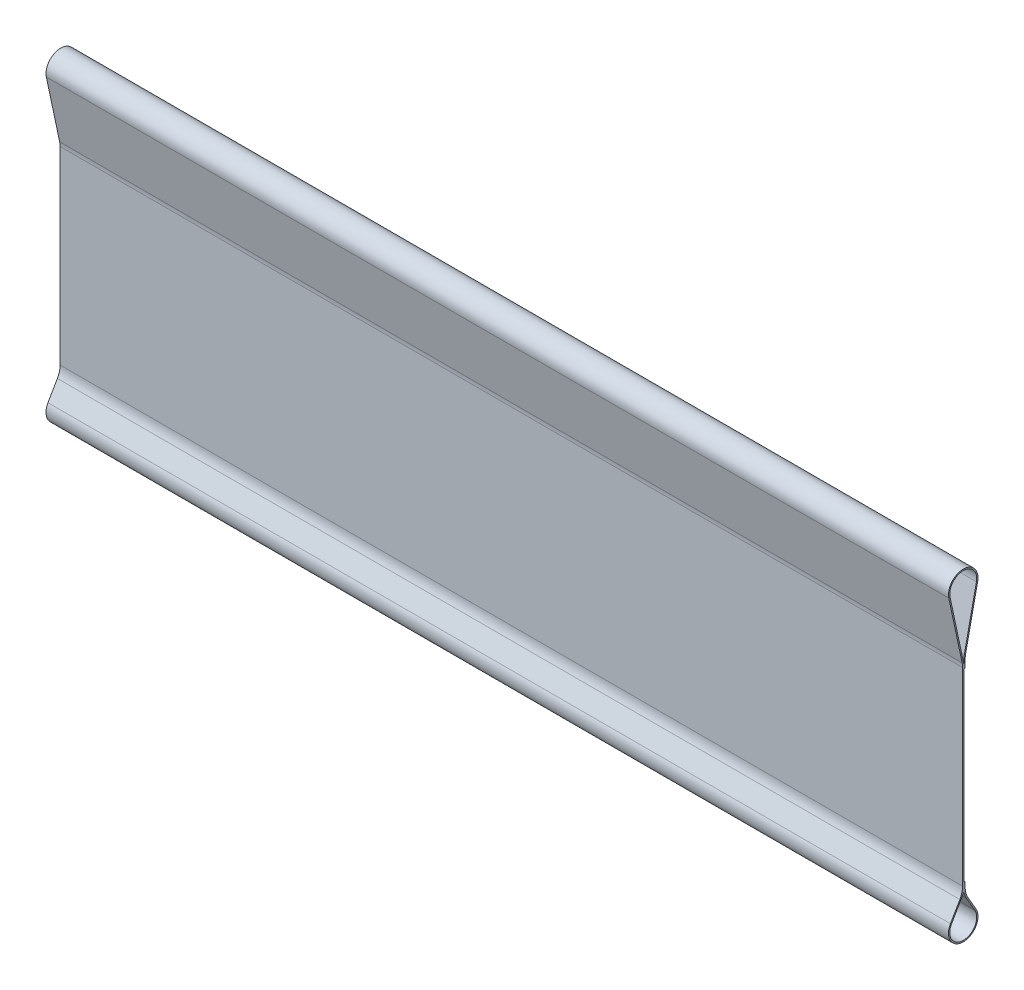
ISO-10303-21;
HEADER;
FILE_DESCRIPTION(('STEP AP214'),'2;1');
FILE_NAME('part.step','',(''),(''),'','','');
FILE_SCHEMA(('AUTOMOTIVE_DESIGN { 1 0 10303 214 1 1 1 1 }'));
ENDSEC;
DATA;
#1=APPLICATION_CONTEXT('core data for automotive mechanical design processes');
#2=APPLICATION_PROTOCOL_DEFINITION('international standard','automotive_design',2000,#1);
#3=PRODUCT_CONTEXT('',#1,'mechanical');
#4=PRODUCT('Part','Part','',(#3));
#5=PRODUCT_RELATED_PRODUCT_CATEGORY('part','',(#4));
#6=PRODUCT_DEFINITION_FORMATION('','',#4);
#7=PRODUCT_DEFINITION_CONTEXT('part definition',#1,'design');
#8=PRODUCT_DEFINITION('design','',#6,#7);
#9=PRODUCT_DEFINITION_SHAPE('','',#8);
#10=(LENGTH_UNIT() NAMED_UNIT(*) SI_UNIT(.MILLI.,.METRE.));
#11=(NAMED_UNIT(*) PLANE_ANGLE_UNIT() SI_UNIT($,.RADIAN.));
#12=(NAMED_UNIT(*) SI_UNIT($,.STERADIAN.) SOLID_ANGLE_UNIT());
#13=UNCERTAINTY_MEASURE_WITH_UNIT(LENGTH_MEASURE(1.E-05),#10,'distance_accuracy_value','');
#14=(GEOMETRIC_REPRESENTATION_CONTEXT(3) GLOBAL_UNCERTAINTY_ASSIGNED_CONTEXT((#13)) GLOBAL_UNIT_ASSIGNED_CONTEXT((#10,
#11,#12)) REPRESENTATION_CONTEXT('',''));
#15=CARTESIAN_POINT('',(0.,0.,0.));
#16=DIRECTION('',(0.,0.,1.));
#17=DIRECTION('',(1.,0.,0.));
#18=AXIS2_PLACEMENT_3D('',#15,#16,#17);
#19=CARTESIAN_POINT('',(558.8,-106.889630657014,-2.38125));
#20=DIRECTION('',(0.,1.,0.));
#21=DIRECTION('',(0.,0.,1.));
#22=AXIS2_PLACEMENT_3D('',#19,#20,#21);
#23=PLANE('',#22);
#24=DIRECTION('',(0.,0.,1.));
#25=VECTOR('',#24,1.);
#26=CARTESIAN_POINT('',(-558.8,-106.889630657014,-2.38125));
#27=LINE('',#26,#25);
#28=CARTESIAN_POINT('',(-558.8,-106.889630657014,-2.38125));
#29=VERTEX_POINT('',#28);
#30=CARTESIAN_POINT('',(-558.8,-106.889630657014,-0.79375));
#31=VERTEX_POINT('',#30);
#32=EDGE_CURVE('E205',#29,#31,#27,.T.);
#33=ORIENTED_EDGE('',*,*,#32,.T.);
#34=DIRECTION('',(-1.,0.,0.));
#35=VECTOR('',#34,1.);
#36=CARTESIAN_POINT('',(-558.8,-106.889630657014,-0.79375));
#37=LINE('',#36,#35);
#38=CARTESIAN_POINT('',(558.8,-106.889630657014,-0.79375));
#39=VERTEX_POINT('',#38);
#40=EDGE_CURVE('E220',#39,#31,#37,.T.);
#41=ORIENTED_EDGE('',*,*,#40,.F.);
#42=DIRECTION('',(0.,0.,1.));
#43=VECTOR('',#42,1.);
#44=CARTESIAN_POINT('',(558.8,-106.889630657014,-2.38125));
#45=LINE('',#44,#43);
#46=CARTESIAN_POINT('',(558.8,-106.889630657014,-2.38125));
#47=VERTEX_POINT('',#46);
#48=EDGE_CURVE('E210',#39,#47,#45,.F.);
#49=ORIENTED_EDGE('',*,*,#48,.T.);
#50=DIRECTION('',(-1.,0.,0.));
#51=VECTOR('',#50,1.);
#52=CARTESIAN_POINT('',(558.8,-106.889630657014,-2.38125));
#53=LINE('',#52,#51);
#54=EDGE_CURVE('E360',#29,#47,#53,.F.);
#55=ORIENTED_EDGE('',*,*,#54,.F.);
#56=EDGE_LOOP('',(#33,#41,#49,#55));
#57=FACE_BOUND('',#56,.T.);
#58=ADVANCED_FACE('F17',(#57),#23,.T.);
#59=CARTESIAN_POINT('',(558.8,121.768600298787,-0.79375));
#60=DIRECTION('',(0.,-1.,0.));
#61=DIRECTION('',(0.,0.,-1.));
#62=AXIS2_PLACEMENT_3D('',#59,#60,#61);
#63=PLANE('',#62);
#64=DIRECTION('',(0.,0.,-1.));
#65=VECTOR('',#64,1.);
#66=CARTESIAN_POINT('',(558.8,121.768600298787,-0.79375));
#67=LINE('',#66,#65);
#68=CARTESIAN_POINT('',(558.8,121.768600298787,-2.38125));
#69=VERTEX_POINT('',#68);
#70=CARTESIAN_POINT('',(558.8,121.768600298787,-0.79375));
#71=VERTEX_POINT('',#70);
#72=EDGE_CURVE('E166',#69,#71,#67,.F.);
#73=ORIENTED_EDGE('',*,*,#72,.T.);
#74=DIRECTION('',(-1.,0.,0.));
#75=VECTOR('',#74,1.);
#76=CARTESIAN_POINT('',(-558.8,121.768600298787,-0.79375));
#77=LINE('',#76,#75);
#78=CARTESIAN_POINT('',(-558.8,121.768600298787,-0.79375));
#79=VERTEX_POINT('',#78);
#80=EDGE_CURVE('E217',#79,#71,#77,.F.);
#81=ORIENTED_EDGE('',*,*,#80,.F.);
#82=DIRECTION('',(0.,0.,-1.));
#83=VECTOR('',#82,1.);
#84=CARTESIAN_POINT('',(-558.8,121.768600298787,-0.79375));
#85=LINE('',#84,#83);
#86=CARTESIAN_POINT('',(-558.8,121.768600298787,-2.38125));
#87=VERTEX_POINT('',#86);
#88=EDGE_CURVE('E200',#79,#87,#85,.T.);
#89=ORIENTED_EDGE('',*,*,#88,.T.);
#90=DIRECTION('',(-1.,0.,0.));
#91=VECTOR('',#90,1.);
#92=CARTESIAN_POINT('',(558.8,121.768600298787,-2.38125));
#93=LINE('',#92,#91);
#94=EDGE_CURVE('E240',#69,#87,#93,.T.);
#95=ORIENTED_EDGE('',*,*,#94,.F.);
#96=EDGE_LOOP('',(#73,#81,#89,#95));
#97=FACE_BOUND('',#96,.T.);
#98=ADVANCED_FACE('F439',(#97),#63,.T.);
#99=CARTESIAN_POINT('',(558.8,-152.04118467148,0.));
#100=DIRECTION('',(1.,0.,0.));
#101=DIRECTION('',(0.,0.,-1.));
#102=AXIS2_PLACEMENT_3D('',#99,#100,#101);
#103=CYLINDRICAL_SURFACE('',#102,18.288);
#104=DIRECTION('',(1.,0.,0.));
#105=VECTOR('',#104,1.);
#106=CARTESIAN_POINT('',(558.8,-142.89718467148,-15.8378725844099));
#107=LINE('',#106,#105);
#108=CARTESIAN_POINT('',(558.8,-142.897184671478,-15.8378725844085));
#109=VERTEX_POINT('',#108);
#110=CARTESIAN_POINT('',(-558.8,-142.897184671478,-15.8378725844085));
#111=VERTEX_POINT('',#110);
#112=EDGE_CURVE('E158',#109,#111,#107,.F.);
#113=ORIENTED_EDGE('',*,*,#112,.F.);
#114=CARTESIAN_POINT('',(558.8,-152.04118467148,0.));
#115=DIRECTION('',(1.,0.,0.));
#116=DIRECTION('',(0.,0.,-1.));
#117=AXIS2_PLACEMENT_3D('',#114,#115,#116);
#118=CIRCLE('',#117,18.288);
#119=CARTESIAN_POINT('',(558.8,-142.897184671479,15.8378725844062));
#120=VERTEX_POINT('',#119);
#121=EDGE_CURVE('E20',#120,#109,#118,.T.);
#122=ORIENTED_EDGE('',*,*,#121,.F.);
#123=DIRECTION('',(1.,0.,0.));
#124=VECTOR('',#123,1.);
#125=CARTESIAN_POINT('',(558.8,-142.897184671483,15.8378725844051));
#126=LINE('',#125,#124);
#127=CARTESIAN_POINT('',(-558.8,-142.897184671479,15.8378725844062));
#128=VERTEX_POINT('',#127);
#129=EDGE_CURVE('E182',#128,#120,#126,.T.);
#130=ORIENTED_EDGE('',*,*,#129,.F.);
#131=CARTESIAN_POINT('',(-558.8,-152.04118467148,0.));
#132=DIRECTION('',(1.,0.,0.));
#133=DIRECTION('',(0.,0.,-1.));
#134=AXIS2_PLACEMENT_3D('',#131,#132,#133);
#135=CIRCLE('',#134,18.288);
#136=EDGE_CURVE('E162',#128,#111,#135,.T.);
#137=ORIENTED_EDGE('',*,*,#136,.T.);
#138=EDGE_LOOP('',(#113,#122,#130,#137));
#139=FACE_BOUND('',#138,.T.);
#140=ADVANCED_FACE('F160',(#139),#103,.T.);
#141=CARTESIAN_POINT('',(558.8,-142.89718467148,-15.8378725844099));
#142=DIRECTION('',(0.,0.500000000000017,-0.866025403784429));
#143=DIRECTION('',(0.,0.866025403784429,0.500000000000017));
#144=AXIS2_PLACEMENT_3D('',#141,#142,#143);
#145=PLANE('',#144);
#146=DIRECTION('',(0.,0.866025403784287,0.500000000000263));
#147=VECTOR('',#146,1.);
#148=CARTESIAN_POINT('',(-558.8,-142.89718467148,-15.8378725844099));
#149=LINE('',#148,#147);
#150=CARTESIAN_POINT('',(-558.8,-125.48372116927,-5.78420474387768));
#151=VERTEX_POINT('',#150);
#152=EDGE_CURVE('E271',#111,#151,#149,.T.);
#153=ORIENTED_EDGE('',*,*,#152,.T.);
#154=DIRECTION('',(-1.,0.,0.));
#155=VECTOR('',#154,1.);
#156=CARTESIAN_POINT('',(2015.70336,-125.483721169267,-5.7842047438755));
#157=LINE('',#156,#155);
#158=CARTESIAN_POINT('',(558.8,-125.48372116927,-5.78420474387768));
#159=VERTEX_POINT('',#158);
#160=EDGE_CURVE('E165',#151,#159,#157,.F.);
#161=ORIENTED_EDGE('',*,*,#160,.T.);
#162=DIRECTION('',(0.,0.866025403784287,0.500000000000263));
#163=VECTOR('',#162,1.);
#164=CARTESIAN_POINT('',(558.8,-142.89718467148,-15.8378725844099));
#165=LINE('',#164,#163);
#166=EDGE_CURVE('E169',#109,#159,#165,.T.);
#167=ORIENTED_EDGE('',*,*,#166,.F.);
#168=ORIENTED_EDGE('',*,*,#112,.T.);
#169=EDGE_LOOP('',(#153,#161,#167,#168));
#170=FACE_BOUND('',#169,.T.);
#171=ADVANCED_FACE('F170',(#170),#145,.T.);
#172=CARTESIAN_POINT('',(2015.70336,-112.783721169267,-27.78125));
#173=DIRECTION('',(-1.,0.,0.));
#174=DIRECTION('',(0.,0.,1.));
#175=AXIS2_PLACEMENT_3D('',#172,#173,#174);
#176=CYLINDRICAL_SURFACE('',#175,25.4);
#177=DIRECTION('',(-1.,0.,0.));
#178=VECTOR('',#177,1.);
#179=CARTESIAN_POINT('',(558.8,-112.783721169267,-2.38125));
#180=LINE('',#179,#178);
#181=CARTESIAN_POINT('',(558.8,-112.783721169267,-2.38125));
#182=VERTEX_POINT('',#181);
#183=CARTESIAN_POINT('',(-558.8,-112.783721169267,-2.38125));
#184=VERTEX_POINT('',#183);
#185=EDGE_CURVE('E221',#182,#184,#180,.T.);
#186=ORIENTED_EDGE('',*,*,#185,.F.);
#187=CARTESIAN_POINT('',(558.8,-112.783721169267,-27.78125));
#188=DIRECTION('',(-1.,0.,0.));
#189=DIRECTION('',(0.,0.,1.));
#190=AXIS2_PLACEMENT_3D('',#187,#188,#189);
#191=CIRCLE('',#190,25.4);
#192=EDGE_CURVE('E175',#159,#182,#191,.T.);
#193=ORIENTED_EDGE('',*,*,#192,.F.);
#194=ORIENTED_EDGE('',*,*,#160,.F.);
#195=CARTESIAN_POINT('',(-558.8,-112.783721169267,-27.78125));
#196=DIRECTION('',(-1.,0.,0.));
#197=DIRECTION('',(0.,0.,1.));
#198=AXIS2_PLACEMENT_3D('',#195,#196,#197);
#199=CIRCLE('',#198,25.4);
#200=EDGE_CURVE('E269',#151,#184,#199,.T.);
#201=ORIENTED_EDGE('',*,*,#200,.T.);
#202=EDGE_LOOP('',(#186,#193,#194,#201));
#203=FACE_BOUND('',#202,.T.);
#204=ADVANCED_FACE('F452',(#203),#176,.F.);
#205=CARTESIAN_POINT('',(558.8,-119.589630657014,-2.38125));
#206=DIRECTION('',(0.,0.,-1.));
#207=DIRECTION('',(-1.,0.,0.));
#208=AXIS2_PLACEMENT_3D('',#205,#206,#207);
#209=PLANE('',#208);
#210=DIRECTION('',(0.,1.,0.));
#211=VECTOR('',#210,1.);
#212=CARTESIAN_POINT('',(558.8,0.,-2.38125));
#213=LINE('',#212,#211);
#214=EDGE_CURVE('E228',#182,#47,#213,.T.);
#215=ORIENTED_EDGE('',*,*,#214,.F.);
#216=ORIENTED_EDGE('',*,*,#185,.T.);
#217=DIRECTION('',(0.,1.,0.));
#218=VECTOR('',#217,1.);
#219=CARTESIAN_POINT('',(-558.8,0.,-2.38125));
#220=LINE('',#219,#218);
#221=EDGE_CURVE('E235',#184,#29,#220,.T.);
#222=ORIENTED_EDGE('',*,*,#221,.T.);
#223=ORIENTED_EDGE('',*,*,#54,.T.);
#224=EDGE_LOOP('',(#215,#216,#222,#223));
#225=FACE_BOUND('',#224,.T.);
#226=ADVANCED_FACE('F367',(#225),#209,.T.);
#227=CARTESIAN_POINT('',(-558.8,0.,-0.79375));
#228=DIRECTION('',(0.,0.,-1.));
#229=DIRECTION('',(-1.,0.,0.));
#230=AXIS2_PLACEMENT_3D('',#227,#228,#229);
#231=PLANE('',#230);
#232=DIRECTION('',(0.,1.,0.));
#233=VECTOR('',#232,1.);
#234=CARTESIAN_POINT('',(558.8,0.,-0.79375));
#235=LINE('',#234,#233);
#236=EDGE_CURVE('E224',#39,#71,#235,.T.);
#237=ORIENTED_EDGE('',*,*,#236,.F.);
#238=ORIENTED_EDGE('',*,*,#40,.T.);
#239=DIRECTION('',(0.,1.,0.));
#240=VECTOR('',#239,1.);
#241=CARTESIAN_POINT('',(-558.8,0.,-0.79375));
#242=LINE('',#241,#240);
#243=EDGE_CURVE('E231',#31,#79,#242,.T.);
#244=ORIENTED_EDGE('',*,*,#243,.T.);
#245=ORIENTED_EDGE('',*,*,#80,.T.);
#246=EDGE_LOOP('',(#237,#238,#244,#245));
#247=FACE_BOUND('',#246,.T.);
#248=ADVANCED_FACE('F442',(#247),#231,.T.);
#249=CARTESIAN_POINT('',(558.8,121.768600298787,-2.38125));
#250=DIRECTION('',(0.,0.,-1.));
#251=DIRECTION('',(-1.,0.,0.));
#252=AXIS2_PLACEMENT_3D('',#249,#250,#251);
#253=PLANE('',#252);
#254=DIRECTION('',(0.,1.,0.));
#255=VECTOR('',#254,1.);
#256=CARTESIAN_POINT('',(-558.8,0.,-2.38125));
#257=LINE('',#256,#255);
#258=CARTESIAN_POINT('',(-558.8,131.798952723056,-2.38125));
#259=VERTEX_POINT('',#258);
#260=EDGE_CURVE('E234',#87,#259,#257,.T.);
#261=ORIENTED_EDGE('',*,*,#260,.T.);
#262=DIRECTION('',(1.,0.,0.));
#263=VECTOR('',#262,1.);
#264=CARTESIAN_POINT('',(-2015.70336,131.798952723056,-2.38125));
#265=LINE('',#264,#263);
#266=CARTESIAN_POINT('',(558.8,131.798952723056,-2.38125));
#267=VERTEX_POINT('',#266);
#268=EDGE_CURVE('E352',#259,#267,#265,.T.);
#269=ORIENTED_EDGE('',*,*,#268,.T.);
#270=DIRECTION('',(0.,1.,0.));
#271=VECTOR('',#270,1.);
#272=CARTESIAN_POINT('',(558.8,0.,-2.38125));
#273=LINE('',#272,#271);
#274=EDGE_CURVE('E227',#69,#267,#273,.T.);
#275=ORIENTED_EDGE('',*,*,#274,.F.);
#276=ORIENTED_EDGE('',*,*,#94,.T.);
#277=EDGE_LOOP('',(#261,#269,#275,#276));
#278=FACE_BOUND('',#277,.T.);
#279=ADVANCED_FACE('F428',(#278),#253,.T.);
#280=CARTESIAN_POINT('',(-2015.70336,131.798952723056,-27.78125));
#281=DIRECTION('',(1.,0.,0.));
#282=DIRECTION('',(0.,0.,-1.));
#283=AXIS2_PLACEMENT_3D('',#280,#281,#282);
#284=CYLINDRICAL_SURFACE('',#283,25.4);
#285=ORIENTED_EDGE('',*,*,#268,.F.);
#286=CARTESIAN_POINT('',(-558.8,131.798952723056,-27.78125));
#287=DIRECTION('',(1.,0.,0.));
#288=DIRECTION('',(0.,0.,-1.));
#289=AXIS2_PLACEMENT_3D('',#286,#287,#288);
#290=CIRCLE('',#289,25.4);
#291=CARTESIAN_POINT('',(-558.8,137.079909669816,-2.93630094136215));
#292=VERTEX_POINT('',#291);
#293=EDGE_CURVE('E267',#259,#292,#290,.F.);
#294=ORIENTED_EDGE('',*,*,#293,.T.);
#295=DIRECTION('',(1.,0.,0.));
#296=VECTOR('',#295,1.);
#297=CARTESIAN_POINT('',(-558.8,137.079909669808,-2.93630094135924));
#298=LINE('',#297,#296);
#299=CARTESIAN_POINT('',(558.8,137.079909669816,-2.93630094136215));
#300=VERTEX_POINT('',#299);
#301=EDGE_CURVE('E349',#300,#292,#298,.F.);
#302=ORIENTED_EDGE('',*,*,#301,.F.);
#303=CARTESIAN_POINT('',(558.8,131.798952723056,-27.78125));
#304=DIRECTION('',(1.,0.,0.));
#305=DIRECTION('',(0.,0.,-1.));
#306=AXIS2_PLACEMENT_3D('',#303,#304,#305);
#307=CIRCLE('',#306,25.4);
#308=EDGE_CURVE('E297',#267,#300,#307,.F.);
#309=ORIENTED_EDGE('',*,*,#308,.F.);
#310=EDGE_LOOP('',(#285,#294,#302,#309));
#311=FACE_BOUND('',#310,.T.);
#312=ADVANCED_FACE('F450',(#311),#284,.F.);
#313=CARTESIAN_POINT('',(-558.8,127.,-0.79375));
#314=DIRECTION('',(0.,-0.207911690817799,-0.978147600733797));
#315=DIRECTION('',(0.,0.978147600733797,-0.207911690817799));
#316=AXIS2_PLACEMENT_3D('',#313,#314,#315);
#317=PLANE('',#316);
#318=DIRECTION('',(0.,0.97814760073382,-0.207911690817693));
#319=VECTOR('',#318,1.);
#320=CARTESIAN_POINT('',(558.8,137.079909669808,-2.93630094136148));
#321=LINE('',#320,#319);
#322=CARTESIAN_POINT('',(558.8,207.423832545616,-17.8883633222195));
#323=VERTEX_POINT('',#322);
#324=EDGE_CURVE('E296',#300,#323,#321,.T.);
#325=ORIENTED_EDGE('',*,*,#324,.F.);
#326=ORIENTED_EDGE('',*,*,#301,.T.);
#327=DIRECTION('',(0.,0.97814760073382,-0.207911690817693));
#328=VECTOR('',#327,1.);
#329=CARTESIAN_POINT('',(-558.8,137.079909669808,-2.93630094136148));
#330=LINE('',#329,#328);
#331=CARTESIAN_POINT('',(-558.8,207.423832545616,-17.8883633222195));
#332=VERTEX_POINT('',#331);
#333=EDGE_CURVE('E266',#292,#332,#330,.T.);
#334=ORIENTED_EDGE('',*,*,#333,.T.);
#335=DIRECTION('',(1.,0.,0.));
#336=VECTOR('',#335,1.);
#337=CARTESIAN_POINT('',(-558.8,207.423832545612,-17.8883633222187));
#338=LINE('',#337,#336);
#339=EDGE_CURVE('E346',#323,#332,#338,.F.);
#340=ORIENTED_EDGE('',*,*,#339,.F.);
#341=EDGE_LOOP('',(#325,#326,#334,#340));
#342=FACE_BOUND('',#341,.T.);
#343=ADVANCED_FACE('F520',(#342),#317,.T.);
#344=CARTESIAN_POINT('',(-558.8,211.226121547293,0.));
#345=DIRECTION('',(1.,0.,0.));
#346=DIRECTION('',(0.,0.,-1.));
#347=AXIS2_PLACEMENT_3D('',#344,#345,#346);
#348=CYLINDRICAL_SURFACE('',#347,18.288);
#349=ORIENTED_EDGE('',*,*,#339,.T.);
#350=CARTESIAN_POINT('',(-558.8,211.226121547293,0.));
#351=DIRECTION('',(1.,0.,0.));
#352=DIRECTION('',(0.,0.,-1.));
#353=AXIS2_PLACEMENT_3D('',#350,#351,#352);
#354=CIRCLE('',#353,18.288);
#355=CARTESIAN_POINT('',(-558.8,207.423832545615,17.8883633222195));
#356=VERTEX_POINT('',#355);
#357=EDGE_CURVE('E264',#332,#356,#354,.T.);
#358=ORIENTED_EDGE('',*,*,#357,.T.);
#359=DIRECTION('',(1.,0.,0.));
#360=VECTOR('',#359,1.);
#361=CARTESIAN_POINT('',(-558.8,207.423832545612,17.8883633222188));
#362=LINE('',#361,#360);
#363=CARTESIAN_POINT('',(558.8,207.423832545615,17.8883633222195));
#364=VERTEX_POINT('',#363);
#365=EDGE_CURVE('E342',#364,#356,#362,.F.);
#366=ORIENTED_EDGE('',*,*,#365,.F.);
#367=CARTESIAN_POINT('',(558.8,211.226121547293,0.));
#368=DIRECTION('',(1.,0.,0.));
#369=DIRECTION('',(0.,0.,-1.));
#370=AXIS2_PLACEMENT_3D('',#367,#368,#369);
#371=CIRCLE('',#370,18.288);
#372=EDGE_CURVE('E292',#323,#364,#371,.T.);
#373=ORIENTED_EDGE('',*,*,#372,.F.);
#374=EDGE_LOOP('',(#349,#358,#366,#373));
#375=FACE_BOUND('',#374,.T.);
#376=ADVANCED_FACE('F516',(#375),#348,.T.);
#377=CARTESIAN_POINT('',(-558.8,207.423832545612,17.8883633222188));
#378=DIRECTION('',(0.,-0.207911690817799,0.978147600733797));
#379=DIRECTION('',(0.,-0.978147600733797,-0.207911690817799));
#380=AXIS2_PLACEMENT_3D('',#377,#378,#379);
#381=PLANE('',#380);
#382=DIRECTION('',(0.,-0.978147600733812,-0.207911690817729));
#383=VECTOR('',#382,1.);
#384=CARTESIAN_POINT('',(-558.8,207.423832545612,17.8883633222188));
#385=LINE('',#384,#383);
#386=CARTESIAN_POINT('',(-558.8,129.611309371017,1.3488009413612));
#387=VERTEX_POINT('',#386);
#388=EDGE_CURVE('E263',#356,#387,#385,.T.);
#389=ORIENTED_EDGE('',*,*,#388,.T.);
#390=DIRECTION('',(1.,0.,0.));
#391=VECTOR('',#390,1.);
#392=CARTESIAN_POINT('',(-2015.70336,129.611309371021,1.34880094136258));
#393=LINE('',#392,#391);
#394=CARTESIAN_POINT('',(558.8,129.611309371017,1.3488009413612));
#395=VERTEX_POINT('',#394);
#396=EDGE_CURVE('E276',#387,#395,#393,.T.);
#397=ORIENTED_EDGE('',*,*,#396,.T.);
#398=DIRECTION('',(0.,-0.978147600733812,-0.207911690817729));
#399=VECTOR('',#398,1.);
#400=CARTESIAN_POINT('',(558.8,207.423832545612,17.8883633222188));
#401=LINE('',#400,#399);
#402=EDGE_CURVE('E295',#364,#395,#401,.T.);
#403=ORIENTED_EDGE('',*,*,#402,.F.);
#404=ORIENTED_EDGE('',*,*,#365,.T.);
#405=EDGE_LOOP('',(#389,#397,#403,#404));
#406=FACE_BOUND('',#405,.T.);
#407=ADVANCED_FACE('F512',(#406),#381,.T.);
#408=CARTESIAN_POINT('',(2020.84392312449,-112.391605771508,-25.7217749648816));
#409=DIRECTION('',(-1.,0.,0.));
#410=DIRECTION('',(0.,0.,1.));
#411=AXIS2_PLACEMENT_3D('',#408,#409,#410);
#412=CYLINDRICAL_SURFACE('',#411,25.4);
#413=DIRECTION('',(1.,0.,0.));
#414=VECTOR('',#413,1.);
#415=CARTESIAN_POINT('',(558.8,-117.265369342985,-0.793749999998308));
#416=LINE('',#415,#414);
#417=CARTESIAN_POINT('',(-558.8,-117.26536934298,-0.793750000002346));
#418=VERTEX_POINT('',#417);
#419=CARTESIAN_POINT('',(558.8,-117.26536934298,-0.793750000002346));
#420=VERTEX_POINT('',#419);
#421=EDGE_CURVE('E332',#418,#420,#416,.T.);
#422=ORIENTED_EDGE('',*,*,#421,.F.);
#423=CARTESIAN_POINT('',(-558.8,-112.391605771508,-25.7217749648816));
#424=DIRECTION('',(-1.,0.,0.));
#425=DIRECTION('',(0.,0.,1.));
#426=AXIS2_PLACEMENT_3D('',#423,#424,#425);
#427=CIRCLE('',#426,25.4);
#428=CARTESIAN_POINT('',(-558.8,-125.091605771515,-3.72472970875147));
#429=VERTEX_POINT('',#428);
#430=EDGE_CURVE('E259',#418,#429,#427,.F.);
#431=ORIENTED_EDGE('',*,*,#430,.T.);
#432=DIRECTION('',(1.,0.,0.));
#433=VECTOR('',#432,1.);
#434=CARTESIAN_POINT('',(558.8,-125.091605771506,-3.72472970874862));
#435=LINE('',#434,#433);
#436=CARTESIAN_POINT('',(558.8,-125.091605771515,-3.72472970875147));
#437=VERTEX_POINT('',#436);
#438=EDGE_CURVE('E339',#437,#429,#435,.F.);
#439=ORIENTED_EDGE('',*,*,#438,.F.);
#440=CARTESIAN_POINT('',(558.8,-112.391605771508,-25.7217749648816));
#441=DIRECTION('',(-1.,0.,0.));
#442=DIRECTION('',(0.,0.,1.));
#443=AXIS2_PLACEMENT_3D('',#440,#441,#442);
#444=CIRCLE('',#443,25.4);
#445=EDGE_CURVE('E284',#420,#437,#444,.F.);
#446=ORIENTED_EDGE('',*,*,#445,.F.);
#447=EDGE_LOOP('',(#422,#431,#439,#446));
#448=FACE_BOUND('',#447,.T.);
#449=ADVANCED_FACE('F508',(#448),#412,.T.);
#450=CARTESIAN_POINT('',(558.8,-120.015,-0.79375));
#451=DIRECTION('',(0.,-0.500000000000017,0.866025403784429));
#452=DIRECTION('',(0.,-0.866025403784429,-0.500000000000017));
#453=AXIS2_PLACEMENT_3D('',#450,#451,#452);
#454=PLANE('',#453);
#455=DIRECTION('',(0.,-0.866025403784192,-0.500000000000427));
#456=VECTOR('',#455,1.);
#457=CARTESIAN_POINT('',(558.8,-125.091605771508,-3.72472970874514));
#458=LINE('',#457,#456);
#459=CARTESIAN_POINT('',(558.8,-143.690934671477,-14.4630572559004));
#460=VERTEX_POINT('',#459);
#461=EDGE_CURVE('E291',#437,#460,#458,.T.);
#462=ORIENTED_EDGE('',*,*,#461,.F.);
#463=ORIENTED_EDGE('',*,*,#438,.T.);
#464=DIRECTION('',(0.,-0.866025403784192,-0.500000000000427));
#465=VECTOR('',#464,1.);
#466=CARTESIAN_POINT('',(-558.8,-125.091605771508,-3.72472970874514));
#467=LINE('',#466,#465);
#468=CARTESIAN_POINT('',(-558.8,-143.690934671477,-14.4630572559004));
#469=VERTEX_POINT('',#468);
#470=EDGE_CURVE('E258',#429,#469,#467,.T.);
#471=ORIENTED_EDGE('',*,*,#470,.T.);
#472=DIRECTION('',(1.,0.,0.));
#473=VECTOR('',#472,1.);
#474=CARTESIAN_POINT('',(558.8,-143.690934671481,-14.4630572559022));
#475=LINE('',#474,#473);
#476=EDGE_CURVE('E336',#469,#460,#475,.T.);
#477=ORIENTED_EDGE('',*,*,#476,.T.);
#478=EDGE_LOOP('',(#462,#463,#471,#477));
#479=FACE_BOUND('',#478,.T.);
#480=ADVANCED_FACE('F504',(#479),#454,.T.);
#481=CARTESIAN_POINT('',(558.8,-152.04118467148,0.));
#482=DIRECTION('',(1.,0.,0.));
#483=DIRECTION('',(0.,0.,-1.));
#484=AXIS2_PLACEMENT_3D('',#481,#482,#483);
#485=CYLINDRICAL_SURFACE('',#484,16.7005);
#486=CARTESIAN_POINT('',(-558.8,-152.04118467148,0.));
#487=DIRECTION('',(1.,0.,0.));
#488=DIRECTION('',(0.,0.,-1.));
#489=AXIS2_PLACEMENT_3D('',#486,#487,#488);
#490=CIRCLE('',#489,16.7005);
#491=CARTESIAN_POINT('',(-558.8,-143.690934671479,14.4630572558998));
#492=VERTEX_POINT('',#491);
#493=EDGE_CURVE('E256',#469,#492,#490,.F.);
#494=ORIENTED_EDGE('',*,*,#493,.T.);
#495=DIRECTION('',(1.,0.,0.));
#496=VECTOR('',#495,1.);
#497=CARTESIAN_POINT('',(558.8,-143.69093467148,14.4630572559003));
#498=LINE('',#497,#496);
#499=CARTESIAN_POINT('',(558.8,-143.690934671479,14.4630572558998));
#500=VERTEX_POINT('',#499);
#501=EDGE_CURVE('E333',#500,#492,#498,.F.);
#502=ORIENTED_EDGE('',*,*,#501,.F.);
#503=CARTESIAN_POINT('',(558.8,-152.04118467148,0.));
#504=DIRECTION('',(1.,0.,0.));
#505=DIRECTION('',(0.,0.,-1.));
#506=AXIS2_PLACEMENT_3D('',#503,#504,#505);
#507=CIRCLE('',#506,16.7005);
#508=EDGE_CURVE('E288',#460,#500,#507,.F.);
#509=ORIENTED_EDGE('',*,*,#508,.F.);
#510=ORIENTED_EDGE('',*,*,#476,.F.);
#511=EDGE_LOOP('',(#494,#502,#509,#510));
#512=FACE_BOUND('',#511,.T.);
#513=ADVANCED_FACE('F500',(#512),#485,.F.);
#514=CARTESIAN_POINT('',(558.8,-143.69093467148,14.4630572559003));
#515=DIRECTION('',(0.,-0.500000000000092,-0.866025403784386));
#516=DIRECTION('',(0.,0.866025403784386,-0.500000000000092));
#517=AXIS2_PLACEMENT_3D('',#514,#515,#516);
#518=PLANE('',#517);
#519=DIRECTION('',(0.,0.866025403784354,-0.500000000000147));
#520=VECTOR('',#519,1.);
#521=CARTESIAN_POINT('',(-558.8,-143.69093467148,14.4630572559003));
#522=LINE('',#521,#520);
#523=EDGE_CURVE('E255',#492,#418,#522,.T.);
#524=ORIENTED_EDGE('',*,*,#523,.T.);
#525=ORIENTED_EDGE('',*,*,#421,.T.);
#526=DIRECTION('',(0.,0.866025403784354,-0.500000000000147));
#527=VECTOR('',#526,1.);
#528=CARTESIAN_POINT('',(558.8,-143.69093467148,14.4630572559003));
#529=LINE('',#528,#527);
#530=EDGE_CURVE('E287',#500,#420,#529,.T.);
#531=ORIENTED_EDGE('',*,*,#530,.F.);
#532=ORIENTED_EDGE('',*,*,#501,.T.);
#533=EDGE_LOOP('',(#524,#525,#531,#532));
#534=FACE_BOUND('',#533,.T.);
#535=ADVANCED_FACE('F496',(#534),#518,.T.);
#536=CARTESIAN_POINT('',(-2015.70336,131.965805696537,-26.19375));
#537=DIRECTION('',(1.,0.,0.));
#538=DIRECTION('',(0.,0.,-1.));
#539=AXIS2_PLACEMENT_3D('',#536,#537,#538);
#540=CYLINDRICAL_SURFACE('',#539,25.4);
#541=DIRECTION('',(-1.,0.,0.));
#542=VECTOR('',#541,1.);
#543=CARTESIAN_POINT('',(558.8,131.965805696537,-0.79375));
#544=LINE('',#543,#542);
#545=CARTESIAN_POINT('',(-558.8,131.965805696537,-0.79375));
#546=VERTEX_POINT('',#545);
#547=CARTESIAN_POINT('',(558.8,131.965805696537,-0.79375));
#548=VERTEX_POINT('',#547);
#549=EDGE_CURVE('E328',#546,#548,#544,.F.);
#550=ORIENTED_EDGE('',*,*,#549,.T.);
#551=CARTESIAN_POINT('',(558.8,131.965805696537,-26.19375));
#552=DIRECTION('',(1.,0.,0.));
#553=DIRECTION('',(0.,0.,-1.));
#554=AXIS2_PLACEMENT_3D('',#551,#552,#553);
#555=CIRCLE('',#554,25.4);
#556=CARTESIAN_POINT('',(558.8,137.246762643312,-1.34880094136037));
#557=VERTEX_POINT('',#556);
#558=EDGE_CURVE('E277',#557,#548,#555,.T.);
#559=ORIENTED_EDGE('',*,*,#558,.F.);
#560=DIRECTION('',(1.,0.,0.));
#561=VECTOR('',#560,1.);
#562=CARTESIAN_POINT('',(-558.8,137.246762643315,-1.34880094136057));
#563=LINE('',#562,#561);
#564=CARTESIAN_POINT('',(-558.8,137.246762643312,-1.34880094136037));
#565=VERTEX_POINT('',#564);
#566=EDGE_CURVE('E183',#565,#557,#563,.T.);
#567=ORIENTED_EDGE('',*,*,#566,.F.);
#568=CARTESIAN_POINT('',(-558.8,131.965805696537,-26.19375));
#569=DIRECTION('',(1.,0.,0.));
#570=DIRECTION('',(0.,0.,-1.));
#571=AXIS2_PLACEMENT_3D('',#568,#569,#570);
#572=CIRCLE('',#571,25.4);
#573=EDGE_CURVE('E252',#565,#546,#572,.T.);
#574=ORIENTED_EDGE('',*,*,#573,.T.);
#575=EDGE_LOOP('',(#550,#559,#567,#574));
#576=FACE_BOUND('',#575,.T.);
#577=ADVANCED_FACE('F492',(#576),#540,.T.);
#578=CARTESIAN_POINT('',(558.8,127.,-0.79375));
#579=DIRECTION('',(0.,0.,-1.));
#580=DIRECTION('',(-1.,0.,0.));
#581=AXIS2_PLACEMENT_3D('',#578,#579,#580);
#582=PLANE('',#581);
#583=DIRECTION('',(1.,0.,0.));
#584=VECTOR('',#583,1.);
#585=CARTESIAN_POINT('',(558.8,127.,-0.793749999998688));
#586=LINE('',#585,#584);
#587=CARTESIAN_POINT('',(-558.8,127.,-0.793749999999606));
#588=VERTEX_POINT('',#587);
#589=CARTESIAN_POINT('',(558.8,127.,-0.793749999999606));
#590=VERTEX_POINT('',#589);
#591=EDGE_CURVE('E318',#588,#590,#586,.T.);
#592=ORIENTED_EDGE('',*,*,#591,.T.);
#593=DIRECTION('',(0.,1.,0.));
#594=VECTOR('',#593,1.);
#595=CARTESIAN_POINT('',(558.8,0.,-0.79375));
#596=LINE('',#595,#594);
#597=EDGE_CURVE('E195',#548,#590,#596,.F.);
#598=ORIENTED_EDGE('',*,*,#597,.F.);
#599=ORIENTED_EDGE('',*,*,#549,.F.);
#600=DIRECTION('',(0.,1.,0.));
#601=VECTOR('',#600,1.);
#602=CARTESIAN_POINT('',(-558.8,0.,-0.79375));
#603=LINE('',#602,#601);
#604=EDGE_CURVE('E254',#546,#588,#603,.F.);
#605=ORIENTED_EDGE('',*,*,#604,.T.);
#606=EDGE_LOOP('',(#592,#598,#599,#605));
#607=FACE_BOUND('',#606,.T.);
#608=ADVANCED_FACE('F488',(#607),#582,.F.);
#609=CARTESIAN_POINT('',(558.8,130.901153122875,0.));
#610=DIRECTION('',(0.,-0.199380338723698,0.97992218085439));
#611=DIRECTION('',(0.,-0.97992218085439,-0.199380338723698));
#612=AXIS2_PLACEMENT_3D('',#609,#610,#611);
#613=PLANE('',#612);
#614=DIRECTION('',(0.,0.979922180854323,0.199380338724028));
#615=VECTOR('',#614,1.);
#616=CARTESIAN_POINT('',(558.8,127.,-0.79375));
#617=LINE('',#616,#615);
#618=CARTESIAN_POINT('',(558.8,130.901153122874,-1.4097892173129E-13));
#619=VERTEX_POINT('',#618);
#620=EDGE_CURVE('E191',#590,#619,#617,.T.);
#621=ORIENTED_EDGE('',*,*,#620,.F.);
#622=ORIENTED_EDGE('',*,*,#591,.F.);
#623=DIRECTION('',(0.,0.979922180854323,0.199380338724028));
#624=VECTOR('',#623,1.);
#625=CARTESIAN_POINT('',(-558.8,127.,-0.79375));
#626=LINE('',#625,#624);
#627=CARTESIAN_POINT('',(-558.8,130.901153122874,-1.86190152323935E-13));
#628=VERTEX_POINT('',#627);
#629=EDGE_CURVE('E321',#588,#628,#626,.T.);
#630=ORIENTED_EDGE('',*,*,#629,.T.);
#631=DIRECTION('',(1.,0.,0.));
#632=VECTOR('',#631,1.);
#633=CARTESIAN_POINT('',(-558.8,130.901153122875,0.));
#634=LINE('',#633,#632);
#635=EDGE_CURVE('E315',#619,#628,#634,.F.);
#636=ORIENTED_EDGE('',*,*,#635,.F.);
#637=EDGE_LOOP('',(#621,#622,#630,#636));
#638=FACE_BOUND('',#637,.T.);
#639=ADVANCED_FACE('F484',(#638),#613,.F.);
#640=CARTESIAN_POINT('',(-558.8,130.901153122875,0.));
#641=DIRECTION('',(0.,0.207911690817799,-0.978147600733797));
#642=DIRECTION('',(0.,0.978147600733797,0.207911690817799));
#643=AXIS2_PLACEMENT_3D('',#640,#641,#642);
#644=PLANE('',#643);
#645=DIRECTION('',(0.,0.97814760073381,0.207911690817739));
#646=VECTOR('',#645,1.);
#647=CARTESIAN_POINT('',(558.8,130.901153122875,0.));
#648=LINE('',#647,#646);
#649=CARTESIAN_POINT('',(558.8,207.753892354787,16.3355540060552));
#650=VERTEX_POINT('',#649);
#651=EDGE_CURVE('E194',#619,#650,#648,.T.);
#652=ORIENTED_EDGE('',*,*,#651,.F.);
#653=ORIENTED_EDGE('',*,*,#635,.T.);
#654=DIRECTION('',(0.,0.97814760073381,0.207911690817739));
#655=VECTOR('',#654,1.);
#656=CARTESIAN_POINT('',(-558.8,130.901153122875,0.));
#657=LINE('',#656,#655);
#658=CARTESIAN_POINT('',(-558.8,207.753892354787,16.3355540060552));
#659=VERTEX_POINT('',#658);
#660=EDGE_CURVE('E251',#628,#659,#657,.T.);
#661=ORIENTED_EDGE('',*,*,#660,.T.);
#662=DIRECTION('',(1.,0.,0.));
#663=VECTOR('',#662,1.);
#664=CARTESIAN_POINT('',(-558.8,207.753892354783,16.3355540060533));
#665=LINE('',#664,#663);
#666=EDGE_CURVE('E312',#659,#650,#665,.T.);
#667=ORIENTED_EDGE('',*,*,#666,.T.);
#668=EDGE_LOOP('',(#652,#653,#661,#667));
#669=FACE_BOUND('',#668,.T.);
#670=ADVANCED_FACE('F480',(#669),#644,.T.);
#671=CARTESIAN_POINT('',(-558.8,211.226121547293,0.));
#672=DIRECTION('',(1.,0.,0.));
#673=DIRECTION('',(0.,0.,-1.));
#674=AXIS2_PLACEMENT_3D('',#671,#672,#673);
#675=CYLINDRICAL_SURFACE('',#674,16.7005);
#676=CARTESIAN_POINT('',(558.8,211.226121547293,0.));
#677=DIRECTION('',(1.,0.,0.));
#678=DIRECTION('',(0.,0.,-1.));
#679=AXIS2_PLACEMENT_3D('',#676,#677,#678);
#680=CIRCLE('',#679,16.7005);
#681=CARTESIAN_POINT('',(558.8,207.753892354786,-16.3355540060563));
#682=VERTEX_POINT('',#681);
#683=EDGE_CURVE('E281',#650,#682,#680,.F.);
#684=ORIENTED_EDGE('',*,*,#683,.F.);
#685=ORIENTED_EDGE('',*,*,#666,.F.);
#686=CARTESIAN_POINT('',(-558.8,211.226121547293,0.));
#687=DIRECTION('',(1.,0.,0.));
#688=DIRECTION('',(0.,0.,-1.));
#689=AXIS2_PLACEMENT_3D('',#686,#687,#688);
#690=CIRCLE('',#689,16.7005);
#691=CARTESIAN_POINT('',(-558.8,207.753892354786,-16.3355540060563));
#692=VERTEX_POINT('',#691);
#693=EDGE_CURVE('E248',#659,#692,#690,.F.);
#694=ORIENTED_EDGE('',*,*,#693,.T.);
#695=DIRECTION('',(1.,0.,0.));
#696=VECTOR('',#695,1.);
#697=CARTESIAN_POINT('',(-558.8,207.753892354783,-16.3355540060555));
#698=LINE('',#697,#696);
#699=EDGE_CURVE('E187',#682,#692,#698,.F.);
#700=ORIENTED_EDGE('',*,*,#699,.F.);
#701=EDGE_LOOP('',(#684,#685,#694,#700));
#702=FACE_BOUND('',#701,.T.);
#703=ADVANCED_FACE('F476',(#702),#675,.F.);
#704=CARTESIAN_POINT('',(-558.8,207.753892354783,-16.3355540060555));
#705=DIRECTION('',(0.,0.207911690817799,0.978147600733797));
#706=DIRECTION('',(0.,-0.978147600733797,0.207911690817799));
#707=AXIS2_PLACEMENT_3D('',#704,#705,#706);
#708=PLANE('',#707);
#709=DIRECTION('',(0.,-0.978147600733799,0.20791169081779));
#710=VECTOR('',#709,1.);
#711=CARTESIAN_POINT('',(-558.8,207.753892354783,-16.3355540060555));
#712=LINE('',#711,#710);
#713=EDGE_CURVE('E250',#692,#565,#712,.T.);
#714=ORIENTED_EDGE('',*,*,#713,.T.);
#715=ORIENTED_EDGE('',*,*,#566,.T.);
#716=DIRECTION('',(0.,-0.978147600733799,0.20791169081779));
#717=VECTOR('',#716,1.);
#718=CARTESIAN_POINT('',(558.8,207.753892354783,-16.3355540060555));
#719=LINE('',#718,#717);
#720=EDGE_CURVE('E280',#682,#557,#719,.T.);
#721=ORIENTED_EDGE('',*,*,#720,.F.);
#722=ORIENTED_EDGE('',*,*,#699,.T.);
#723=EDGE_LOOP('',(#714,#715,#721,#722));
#724=FACE_BOUND('',#723,.T.);
#725=ADVANCED_FACE('F473',(#724),#708,.T.);
#726=CARTESIAN_POINT('',(558.8,-116.84,0.79375));
#727=DIRECTION('',(0.,0.500000000000017,0.866025403784429));
#728=DIRECTION('',(0.,-0.866025403784429,0.500000000000017));
#729=AXIS2_PLACEMENT_3D('',#726,#727,#728);
#730=PLANE('',#729);
#731=DIRECTION('',(0.,-0.866025403784292,0.500000000000253));
#732=VECTOR('',#731,1.);
#733=CARTESIAN_POINT('',(558.8,-122.734090512253,4.19670474387624));
#734=LINE('',#733,#732);
#735=CARTESIAN_POINT('',(558.8,-122.734090512256,4.19670474387761));
#736=VERTEX_POINT('',#735);
#737=EDGE_CURVE('E181',#736,#120,#734,.T.);
#738=ORIENTED_EDGE('',*,*,#737,.F.);
#739=DIRECTION('',(1.,0.,0.));
#740=VECTOR('',#739,1.);
#741=CARTESIAN_POINT('',(-2015.70336,-122.734090512253,4.19670474387551));
#742=LINE('',#741,#740);
#743=CARTESIAN_POINT('',(-558.8,-122.734090512256,4.19670474387761));
#744=VERTEX_POINT('',#743);
#745=EDGE_CURVE('E247',#736,#744,#742,.F.);
#746=ORIENTED_EDGE('',*,*,#745,.T.);
#747=DIRECTION('',(0.,-0.866025403784292,0.500000000000253));
#748=VECTOR('',#747,1.);
#749=CARTESIAN_POINT('',(-558.8,-122.734090512253,4.19670474387624));
#750=LINE('',#749,#748);
#751=EDGE_CURVE('E273',#744,#128,#750,.T.);
#752=ORIENTED_EDGE('',*,*,#751,.T.);
#753=ORIENTED_EDGE('',*,*,#129,.T.);
#754=EDGE_LOOP('',(#738,#746,#752,#753));
#755=FACE_BOUND('',#754,.T.);
#756=ADVANCED_FACE('F385',(#755),#730,.T.);
#757=CARTESIAN_POINT('',(558.8,0.,0.));
#758=DIRECTION('',(1.,0.,0.));
#759=DIRECTION('',(0.,0.,-1.));
#760=AXIS2_PLACEMENT_3D('',#757,#758,#759);
#761=PLANE('',#760);
#762=ORIENTED_EDGE('',*,*,#720,.T.);
#763=ORIENTED_EDGE('',*,*,#558,.T.);
#764=ORIENTED_EDGE('',*,*,#597,.T.);
#765=ORIENTED_EDGE('',*,*,#620,.T.);
#766=ORIENTED_EDGE('',*,*,#651,.T.);
#767=ORIENTED_EDGE('',*,*,#683,.T.);
#768=EDGE_LOOP('',(#762,#763,#764,#765,#766,#767));
#769=FACE_BOUND('',#768,.T.);
#770=ORIENTED_EDGE('',*,*,#530,.T.);
#771=ORIENTED_EDGE('',*,*,#445,.T.);
#772=ORIENTED_EDGE('',*,*,#461,.T.);
#773=ORIENTED_EDGE('',*,*,#508,.T.);
#774=EDGE_LOOP('',(#770,#771,#772,#773));
#775=FACE_BOUND('',#774,.T.);
#776=CARTESIAN_POINT('',(558.8,-110.034090512253,26.19375));
#777=DIRECTION('',(1.,0.,0.));
#778=DIRECTION('',(0.,0.,-1.));
#779=AXIS2_PLACEMENT_3D('',#776,#777,#778);
#780=CIRCLE('',#779,25.4);
#781=CARTESIAN_POINT('',(558.8,-110.034090512253,0.79375));
#782=VERTEX_POINT('',#781);
#783=EDGE_CURVE('E243',#782,#736,#780,.F.);
#784=ORIENTED_EDGE('',*,*,#783,.T.);
#785=ORIENTED_EDGE('',*,*,#737,.T.);
#786=ORIENTED_EDGE('',*,*,#121,.T.);
#787=ORIENTED_EDGE('',*,*,#166,.T.);
#788=ORIENTED_EDGE('',*,*,#192,.T.);
#789=ORIENTED_EDGE('',*,*,#214,.T.);
#790=ORIENTED_EDGE('',*,*,#48,.F.);
#791=ORIENTED_EDGE('',*,*,#236,.T.);
#792=ORIENTED_EDGE('',*,*,#72,.F.);
#793=ORIENTED_EDGE('',*,*,#274,.T.);
#794=ORIENTED_EDGE('',*,*,#308,.T.);
#795=ORIENTED_EDGE('',*,*,#324,.T.);
#796=ORIENTED_EDGE('',*,*,#372,.T.);
#797=ORIENTED_EDGE('',*,*,#402,.T.);
#798=CARTESIAN_POINT('',(558.8,124.330352424244,26.19375));
#799=DIRECTION('',(1.,0.,0.));
#800=DIRECTION('',(0.,0.,-1.));
#801=AXIS2_PLACEMENT_3D('',#798,#799,#800);
#802=CIRCLE('',#801,25.4);
#803=CARTESIAN_POINT('',(558.8,124.330352424244,0.79375));
#804=VERTEX_POINT('',#803);
#805=EDGE_CURVE('E274',#395,#804,#802,.F.);
#806=ORIENTED_EDGE('',*,*,#805,.T.);
#807=DIRECTION('',(0.,1.,0.));
#808=VECTOR('',#807,1.);
#809=CARTESIAN_POINT('',(558.8,127.,0.79375));
#810=LINE('',#809,#808);
#811=EDGE_CURVE('E245',#782,#804,#810,.T.);
#812=ORIENTED_EDGE('',*,*,#811,.F.);
#813=EDGE_LOOP('',(#784,#785,#786,#787,#788,#789,#790,#791,#792,#793,#794,#795,#796,#797,#806,#812));
#814=FACE_BOUND('',#813,.T.);
#815=ADVANCED_FACE('F179',(#769,#775,#814),#761,.T.);
#816=CARTESIAN_POINT('',(-2015.70336,124.330352424244,26.19375));
#817=DIRECTION('',(1.,0.,0.));
#818=DIRECTION('',(0.,0.,-1.));
#819=AXIS2_PLACEMENT_3D('',#816,#817,#818);
#820=CYLINDRICAL_SURFACE('',#819,25.4);
#821=ORIENTED_EDGE('',*,*,#396,.F.);
#822=CARTESIAN_POINT('',(-558.8,124.330352424244,26.19375));
#823=DIRECTION('',(1.,0.,0.));
#824=DIRECTION('',(0.,0.,-1.));
#825=AXIS2_PLACEMENT_3D('',#822,#823,#824);
#826=CIRCLE('',#825,25.4);
#827=CARTESIAN_POINT('',(-558.8,124.330352424244,0.79375));
#828=VERTEX_POINT('',#827);
#829=EDGE_CURVE('E261',#387,#828,#826,.F.);
#830=ORIENTED_EDGE('',*,*,#829,.T.);
#831=DIRECTION('',(1.,0.,0.));
#832=VECTOR('',#831,1.);
#833=CARTESIAN_POINT('',(-558.8,124.330352424244,0.79375));
#834=LINE('',#833,#832);
#835=EDGE_CURVE('E398',#804,#828,#834,.F.);
#836=ORIENTED_EDGE('',*,*,#835,.F.);
#837=ORIENTED_EDGE('',*,*,#805,.F.);
#838=EDGE_LOOP('',(#821,#830,#836,#837));
#839=FACE_BOUND('',#838,.T.);
#840=ADVANCED_FACE('F463',(#839),#820,.F.);
#841=CARTESIAN_POINT('',(-558.8,0.,0.));
#842=DIRECTION('',(1.,0.,0.));
#843=DIRECTION('',(0.,0.,-1.));
#844=AXIS2_PLACEMENT_3D('',#841,#842,#843);
#845=PLANE('',#844);
#846=ORIENTED_EDGE('',*,*,#693,.F.);
#847=ORIENTED_EDGE('',*,*,#660,.F.);
#848=ORIENTED_EDGE('',*,*,#629,.F.);
#849=ORIENTED_EDGE('',*,*,#604,.F.);
#850=ORIENTED_EDGE('',*,*,#573,.F.);
#851=ORIENTED_EDGE('',*,*,#713,.F.);
#852=EDGE_LOOP('',(#846,#847,#848,#849,#850,#851));
#853=FACE_BOUND('',#852,.T.);
#854=ORIENTED_EDGE('',*,*,#493,.F.);
#855=ORIENTED_EDGE('',*,*,#470,.F.);
#856=ORIENTED_EDGE('',*,*,#430,.F.);
#857=ORIENTED_EDGE('',*,*,#523,.F.);
#858=EDGE_LOOP('',(#854,#855,#856,#857));
#859=FACE_BOUND('',#858,.T.);
#860=ORIENTED_EDGE('',*,*,#388,.F.);
#861=ORIENTED_EDGE('',*,*,#357,.F.);
#862=ORIENTED_EDGE('',*,*,#333,.F.);
#863=ORIENTED_EDGE('',*,*,#293,.F.);
#864=ORIENTED_EDGE('',*,*,#260,.F.);
#865=ORIENTED_EDGE('',*,*,#88,.F.);
#866=ORIENTED_EDGE('',*,*,#243,.F.);
#867=ORIENTED_EDGE('',*,*,#32,.F.);
#868=ORIENTED_EDGE('',*,*,#221,.F.);
#869=ORIENTED_EDGE('',*,*,#200,.F.);
#870=ORIENTED_EDGE('',*,*,#152,.F.);
#871=ORIENTED_EDGE('',*,*,#136,.F.);
#872=ORIENTED_EDGE('',*,*,#751,.F.);
#873=CARTESIAN_POINT('',(-558.8,-110.034090512253,26.19375));
#874=DIRECTION('',(1.,0.,0.));
#875=DIRECTION('',(0.,0.,-1.));
#876=AXIS2_PLACEMENT_3D('',#873,#874,#875);
#877=CIRCLE('',#876,25.4);
#878=CARTESIAN_POINT('',(-558.8,-110.034090512253,0.79375));
#879=VERTEX_POINT('',#878);
#880=EDGE_CURVE('E35',#744,#879,#877,.T.);
#881=ORIENTED_EDGE('',*,*,#880,.T.);
#882=DIRECTION('',(0.,1.,0.));
#883=VECTOR('',#882,1.);
#884=CARTESIAN_POINT('',(-558.8,127.,0.79375));
#885=LINE('',#884,#883);
#886=EDGE_CURVE('E26',#828,#879,#885,.F.);
#887=ORIENTED_EDGE('',*,*,#886,.F.);
#888=ORIENTED_EDGE('',*,*,#829,.F.);
#889=EDGE_LOOP('',(#860,#861,#862,#863,#864,#865,#866,#867,#868,#869,#870,#871,#872,#881,#887,#888));
#890=FACE_BOUND('',#889,.T.);
#891=ADVANCED_FACE('F389',(#853,#859,#890),#845,.F.);
#892=CARTESIAN_POINT('',(-2015.70336,-110.034090512253,26.19375));
#893=DIRECTION('',(1.,0.,0.));
#894=DIRECTION('',(0.,0.,-1.));
#895=AXIS2_PLACEMENT_3D('',#892,#893,#894);
#896=CYLINDRICAL_SURFACE('',#895,25.4);
#897=DIRECTION('',(1.,0.,0.));
#898=VECTOR('',#897,1.);
#899=CARTESIAN_POINT('',(-558.8,-110.034090512253,0.79375));
#900=LINE('',#899,#898);
#901=EDGE_CURVE('E11',#879,#782,#900,.T.);
#902=ORIENTED_EDGE('',*,*,#901,.F.);
#903=ORIENTED_EDGE('',*,*,#880,.F.);
#904=ORIENTED_EDGE('',*,*,#745,.F.);
#905=ORIENTED_EDGE('',*,*,#783,.F.);
#906=EDGE_LOOP('',(#902,#903,#904,#905));
#907=FACE_BOUND('',#906,.T.);
#908=ADVANCED_FACE('F391',(#907),#896,.F.);
#909=CARTESIAN_POINT('',(-558.8,127.,0.79375));
#910=DIRECTION('',(0.,0.,1.));
#911=DIRECTION('',(1.,0.,0.));
#912=AXIS2_PLACEMENT_3D('',#909,#910,#911);
#913=PLANE('',#912);
#914=ORIENTED_EDGE('',*,*,#886,.T.);
#915=ORIENTED_EDGE('',*,*,#901,.T.);
#916=ORIENTED_EDGE('',*,*,#811,.T.);
#917=ORIENTED_EDGE('',*,*,#835,.T.);
#918=EDGE_LOOP('',(#914,#915,#916,#917));
#919=FACE_BOUND('',#918,.T.);
#920=ADVANCED_FACE('F396',(#919),#913,.T.);
#921=CLOSED_SHELL('',(#58,#98,#140,#171,#204,#226,#248,#279,#312,#343,#376,#407,#449,#480,#513,
#535,#577,#608,#639,#670,#703,#725,#756,#815,#840,#891,#908,#920));
#922=MANIFOLD_SOLID_BREP('B1',#921);
#923=ADVANCED_BREP_SHAPE_REPRESENTATION('',(#18,#922),#14);
#924=SHAPE_DEFINITION_REPRESENTATION(#9,#923);
ENDSEC;
END-ISO-10303-21;
